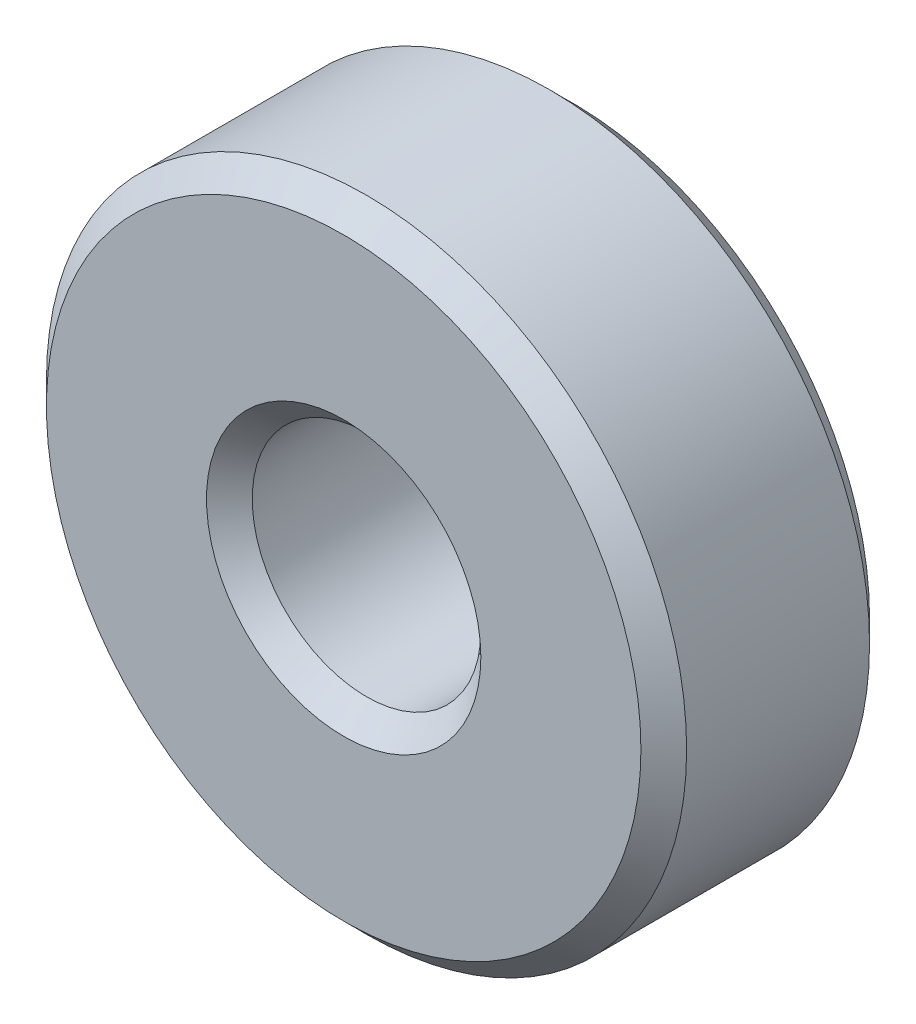
ISO-10303-21;
HEADER;
FILE_DESCRIPTION(('STEP AP214'),'2;1');
FILE_NAME('part.step','',(''),(''),'','','');
FILE_SCHEMA(('AUTOMOTIVE_DESIGN { 1 0 10303 214 1 1 1 1 }'));
ENDSEC;
DATA;
#1=APPLICATION_CONTEXT('core data for automotive mechanical design processes');
#2=APPLICATION_PROTOCOL_DEFINITION('international standard','automotive_design',2000,#1);
#3=PRODUCT_CONTEXT('',#1,'mechanical');
#4=PRODUCT('Part','Part','',(#3));
#5=PRODUCT_RELATED_PRODUCT_CATEGORY('part','',(#4));
#6=PRODUCT_DEFINITION_FORMATION('','',#4);
#7=PRODUCT_DEFINITION_CONTEXT('part definition',#1,'design');
#8=PRODUCT_DEFINITION('design','',#6,#7);
#9=PRODUCT_DEFINITION_SHAPE('','',#8);
#10=(LENGTH_UNIT() NAMED_UNIT(*) SI_UNIT(.MILLI.,.METRE.));
#11=(NAMED_UNIT(*) PLANE_ANGLE_UNIT() SI_UNIT($,.RADIAN.));
#12=(NAMED_UNIT(*) SI_UNIT($,.STERADIAN.) SOLID_ANGLE_UNIT());
#13=UNCERTAINTY_MEASURE_WITH_UNIT(LENGTH_MEASURE(1.E-05),#10,'distance_accuracy_value','');
#14=(GEOMETRIC_REPRESENTATION_CONTEXT(3) GLOBAL_UNCERTAINTY_ASSIGNED_CONTEXT((#13)) GLOBAL_UNIT_ASSIGNED_CONTEXT((#10,
#11,#12)) REPRESENTATION_CONTEXT('',''));
#15=CARTESIAN_POINT('',(0.,0.,0.));
#16=DIRECTION('',(0.,0.,1.));
#17=DIRECTION('',(1.,0.,0.));
#18=AXIS2_PLACEMENT_3D('',#15,#16,#17);
#19=CARTESIAN_POINT('',(0.,0.,5.));
#20=DIRECTION('',(0.,0.,1.));
#21=DIRECTION('',(1.,0.,0.));
#22=AXIS2_PLACEMENT_3D('',#19,#20,#21);
#23=PLANE('',#22);
#24=CARTESIAN_POINT('',(0.,0.,5.));
#25=DIRECTION('',(0.,0.,1.));
#26=DIRECTION('',(1.,0.,0.));
#27=AXIS2_PLACEMENT_3D('',#24,#25,#26);
#28=CIRCLE('',#27,3.00000000000001);
#29=CARTESIAN_POINT('',(3.00000000000001,0.,5.));
#30=VERTEX_POINT('',#29);
#31=EDGE_CURVE('E10',#30,#30,#28,.F.);
#32=ORIENTED_EDGE('',*,*,#31,.T.);
#33=EDGE_LOOP('',(#32));
#34=FACE_BOUND('',#33,.T.);
#35=CARTESIAN_POINT('',(0.,0.,5.));
#36=DIRECTION('',(0.,0.,1.));
#37=DIRECTION('',(1.,0.,0.));
#38=AXIS2_PLACEMENT_3D('',#35,#36,#37);
#39=CIRCLE('',#38,6.5);
#40=CARTESIAN_POINT('',(6.5,0.,5.));
#41=VERTEX_POINT('',#40);
#42=EDGE_CURVE('E43',#41,#41,#39,.T.);
#43=ORIENTED_EDGE('',*,*,#42,.T.);
#44=EDGE_LOOP('',(#43));
#45=FACE_BOUND('',#44,.T.);
#46=ADVANCED_FACE('F35',(#34,#45),#23,.T.);
#47=CARTESIAN_POINT('',(0.,0.,0.));
#48=DIRECTION('',(0.,0.,1.));
#49=DIRECTION('',(1.,0.,0.));
#50=AXIS2_PLACEMENT_3D('',#47,#48,#49);
#51=PLANE('',#50);
#52=CARTESIAN_POINT('',(0.,0.,0.));
#53=DIRECTION('',(0.,0.,1.));
#54=DIRECTION('',(1.,0.,0.));
#55=AXIS2_PLACEMENT_3D('',#52,#53,#54);
#56=CIRCLE('',#55,3.);
#57=CARTESIAN_POINT('',(3.,0.,0.));
#58=VERTEX_POINT('',#57);
#59=EDGE_CURVE('E62',#58,#58,#56,.T.);
#60=ORIENTED_EDGE('',*,*,#59,.T.);
#61=EDGE_LOOP('',(#60));
#62=FACE_BOUND('',#61,.T.);
#63=CARTESIAN_POINT('',(0.,0.,0.));
#64=DIRECTION('',(0.,0.,1.));
#65=DIRECTION('',(1.,0.,0.));
#66=AXIS2_PLACEMENT_3D('',#63,#64,#65);
#67=CIRCLE('',#66,6.5);
#68=CARTESIAN_POINT('',(6.5,0.,0.));
#69=VERTEX_POINT('',#68);
#70=EDGE_CURVE('E65',#69,#69,#67,.F.);
#71=ORIENTED_EDGE('',*,*,#70,.T.);
#72=EDGE_LOOP('',(#71));
#73=FACE_BOUND('',#72,.T.);
#74=ADVANCED_FACE('F69',(#62,#73),#51,.F.);
#75=CARTESIAN_POINT('',(0.,0.,5.));
#76=DIRECTION('',(0.,0.,-1.));
#77=DIRECTION('',(-1.,0.,0.));
#78=AXIS2_PLACEMENT_3D('',#75,#76,#77);
#79=CYLINDRICAL_SURFACE('',#78,7.);
#80=CARTESIAN_POINT('',(0.,0.,0.5));
#81=DIRECTION('',(0.,0.,1.));
#82=DIRECTION('',(1.,0.,0.));
#83=AXIS2_PLACEMENT_3D('',#80,#81,#82);
#84=CIRCLE('',#83,7.);
#85=CARTESIAN_POINT('',(7.,0.,0.5));
#86=VERTEX_POINT('',#85);
#87=EDGE_CURVE('E47',#86,#86,#84,.T.);
#88=ORIENTED_EDGE('',*,*,#87,.T.);
#89=EDGE_LOOP('',(#88));
#90=FACE_BOUND('',#89,.T.);
#91=CARTESIAN_POINT('',(0.,0.,4.5));
#92=DIRECTION('',(0.,0.,1.));
#93=DIRECTION('',(1.,0.,0.));
#94=AXIS2_PLACEMENT_3D('',#91,#92,#93);
#95=CIRCLE('',#94,7.);
#96=CARTESIAN_POINT('',(7.,0.,4.5));
#97=VERTEX_POINT('',#96);
#98=EDGE_CURVE('E51',#97,#97,#95,.F.);
#99=ORIENTED_EDGE('',*,*,#98,.T.);
#100=EDGE_LOOP('',(#99));
#101=FACE_BOUND('',#100,.T.);
#102=ADVANCED_FACE('F79',(#90,#101),#79,.T.);
#103=CARTESIAN_POINT('',(0.,0.,5.));
#104=DIRECTION('',(0.,0.,-1.));
#105=DIRECTION('',(-1.,0.,0.));
#106=AXIS2_PLACEMENT_3D('',#103,#104,#105);
#107=CYLINDRICAL_SURFACE('',#106,2.5);
#108=CARTESIAN_POINT('',(0.,0.,0.500000000000007));
#109=DIRECTION('',(0.,0.,1.));
#110=DIRECTION('',(1.,0.,0.));
#111=AXIS2_PLACEMENT_3D('',#108,#109,#110);
#112=CIRCLE('',#111,2.5);
#113=CARTESIAN_POINT('',(2.5,0.,0.500000000000007));
#114=VERTEX_POINT('',#113);
#115=EDGE_CURVE('E56',#114,#114,#112,.F.);
#116=ORIENTED_EDGE('',*,*,#115,.T.);
#117=EDGE_LOOP('',(#116));
#118=FACE_BOUND('',#117,.T.);
#119=CARTESIAN_POINT('',(0.,0.,4.49999999999999));
#120=DIRECTION('',(0.,0.,1.));
#121=DIRECTION('',(1.,0.,0.));
#122=AXIS2_PLACEMENT_3D('',#119,#120,#121);
#123=CIRCLE('',#122,2.5);
#124=CARTESIAN_POINT('',(2.5,0.,4.49999999999999));
#125=VERTEX_POINT('',#124);
#126=EDGE_CURVE('E59',#125,#125,#123,.T.);
#127=ORIENTED_EDGE('',*,*,#126,.T.);
#128=EDGE_LOOP('',(#127));
#129=FACE_BOUND('',#128,.T.);
#130=ADVANCED_FACE('F82',(#118,#129),#107,.F.);
#131=CARTESIAN_POINT('',(0.,0.,0.));
#132=DIRECTION('',(0.,0.,-1.));
#133=DIRECTION('',(-1.,0.,0.));
#134=AXIS2_PLACEMENT_3D('',#131,#132,#133);
#135=CONICAL_SURFACE('',#134,3.,0.785398163397448);
#136=ORIENTED_EDGE('',*,*,#115,.F.);
#137=EDGE_LOOP('',(#136));
#138=FACE_BOUND('',#137,.T.);
#139=ORIENTED_EDGE('',*,*,#59,.F.);
#140=EDGE_LOOP('',(#139));
#141=FACE_BOUND('',#140,.T.);
#142=ADVANCED_FACE('F75',(#138,#141),#135,.F.);
#143=CARTESIAN_POINT('',(0.,0.,0.5));
#144=DIRECTION('',(0.,0.,1.));
#145=DIRECTION('',(1.,0.,0.));
#146=AXIS2_PLACEMENT_3D('',#143,#144,#145);
#147=CONICAL_SURFACE('',#146,7.,0.78539816339745);
#148=ORIENTED_EDGE('',*,*,#70,.F.);
#149=EDGE_LOOP('',(#148));
#150=FACE_BOUND('',#149,.T.);
#151=ORIENTED_EDGE('',*,*,#87,.F.);
#152=EDGE_LOOP('',(#151));
#153=FACE_BOUND('',#152,.T.);
#154=ADVANCED_FACE('F71',(#150,#153),#147,.T.);
#155=CARTESIAN_POINT('',(0.,0.,4.49999999999999));
#156=DIRECTION('',(0.,0.,1.));
#157=DIRECTION('',(1.,0.,0.));
#158=AXIS2_PLACEMENT_3D('',#155,#156,#157);
#159=CONICAL_SURFACE('',#158,2.5,0.78539816339745);
#160=ORIENTED_EDGE('',*,*,#31,.F.);
#161=EDGE_LOOP('',(#160));
#162=FACE_BOUND('',#161,.T.);
#163=ORIENTED_EDGE('',*,*,#126,.F.);
#164=EDGE_LOOP('',(#163));
#165=FACE_BOUND('',#164,.T.);
#166=ADVANCED_FACE('F74',(#162,#165),#159,.F.);
#167=CARTESIAN_POINT('',(0.,0.,5.));
#168=DIRECTION('',(0.,0.,-1.));
#169=DIRECTION('',(-1.,0.,0.));
#170=AXIS2_PLACEMENT_3D('',#167,#168,#169);
#171=CONICAL_SURFACE('',#170,6.5,0.785398163397447);
#172=ORIENTED_EDGE('',*,*,#98,.F.);
#173=EDGE_LOOP('',(#172));
#174=FACE_BOUND('',#173,.T.);
#175=ORIENTED_EDGE('',*,*,#42,.F.);
#176=EDGE_LOOP('',(#175));
#177=FACE_BOUND('',#176,.T.);
#178=ADVANCED_FACE('F38',(#174,#177),#171,.T.);
#179=CLOSED_SHELL('',(#46,#74,#102,#130,#142,#154,#166,#178));
#180=MANIFOLD_SOLID_BREP('B2',#179);
#181=ADVANCED_BREP_SHAPE_REPRESENTATION('',(#18,#180),#14);
#182=SHAPE_DEFINITION_REPRESENTATION(#9,#181);
ENDSEC;
END-ISO-10303-21;
